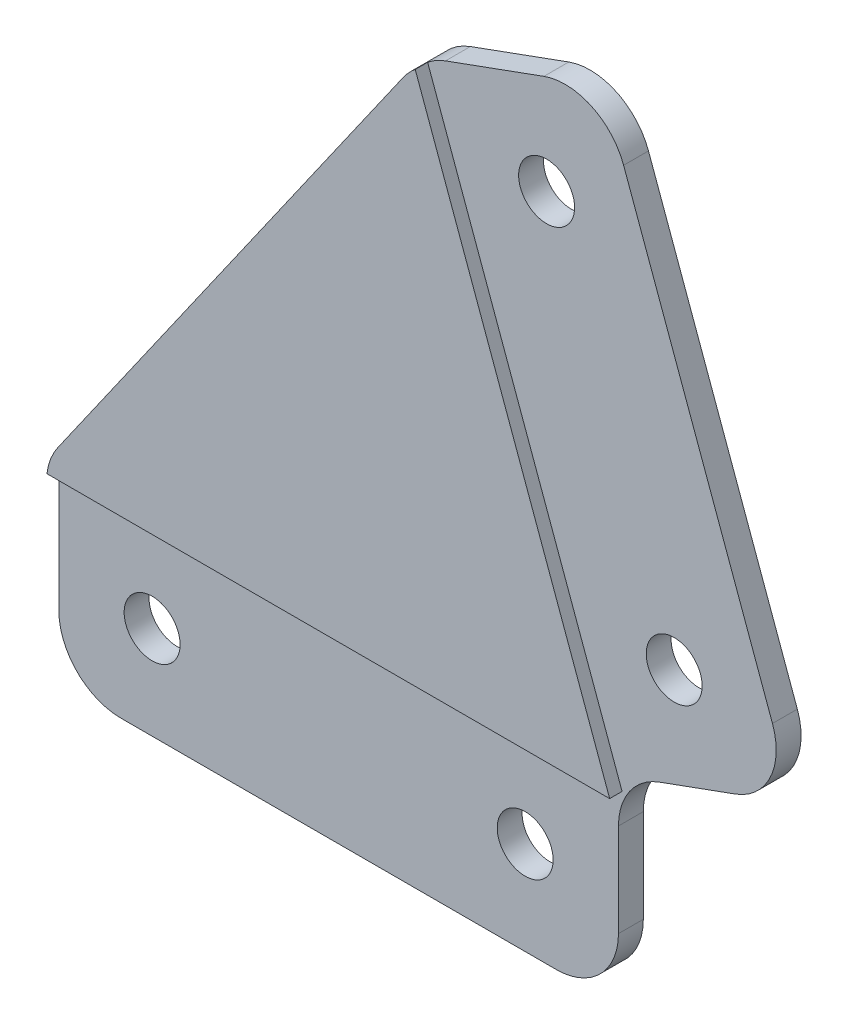
ISO-10303-21;
HEADER;
FILE_DESCRIPTION(('STEP AP214'),'2;1');
FILE_NAME('part.step','',(''),(''),'','','');
FILE_SCHEMA(('AUTOMOTIVE_DESIGN { 1 0 10303 214 1 1 1 1 }'));
ENDSEC;
DATA;
#1=APPLICATION_CONTEXT('core data for automotive mechanical design processes');
#2=APPLICATION_PROTOCOL_DEFINITION('international standard','automotive_design',2000,#1);
#3=PRODUCT_CONTEXT('',#1,'mechanical');
#4=PRODUCT('Part','Part','',(#3));
#5=PRODUCT_RELATED_PRODUCT_CATEGORY('part','',(#4));
#6=PRODUCT_DEFINITION_FORMATION('','',#4);
#7=PRODUCT_DEFINITION_CONTEXT('part definition',#1,'design');
#8=PRODUCT_DEFINITION('design','',#6,#7);
#9=PRODUCT_DEFINITION_SHAPE('','',#8);
#10=(LENGTH_UNIT() NAMED_UNIT(*) SI_UNIT(.MILLI.,.METRE.));
#11=(NAMED_UNIT(*) PLANE_ANGLE_UNIT() SI_UNIT($,.RADIAN.));
#12=(NAMED_UNIT(*) SI_UNIT($,.STERADIAN.) SOLID_ANGLE_UNIT());
#13=UNCERTAINTY_MEASURE_WITH_UNIT(LENGTH_MEASURE(1.E-05),#10,'distance_accuracy_value','');
#14=(GEOMETRIC_REPRESENTATION_CONTEXT(3) GLOBAL_UNCERTAINTY_ASSIGNED_CONTEXT((#13)) GLOBAL_UNIT_ASSIGNED_CONTEXT((#10,
#11,#12)) REPRESENTATION_CONTEXT('',''));
#15=CARTESIAN_POINT('',(0.,0.,0.));
#16=DIRECTION('',(0.,0.,1.));
#17=DIRECTION('',(1.,0.,0.));
#18=AXIS2_PLACEMENT_3D('',#15,#16,#17);
#19=CARTESIAN_POINT('',(0.,-15.9999999999991,3.));
#20=DIRECTION('',(0.,-1.,0.));
#21=DIRECTION('',(1.,0.,0.));
#22=AXIS2_PLACEMENT_3D('',#19,#20,#21);
#23=PLANE('',#22);
#24=DIRECTION('',(0.,0.,-1.));
#25=VECTOR('',#24,1.);
#26=CARTESIAN_POINT('',(435.,-16.0000000000001,3.));
#27=LINE('',#26,#25);
#28=CARTESIAN_POINT('',(435.,-16.0000000000001,0.));
#29=VERTEX_POINT('',#28);
#30=CARTESIAN_POINT('',(435.,-16.0000000000001,2.));
#31=VERTEX_POINT('',#30);
#32=EDGE_CURVE('E291',#29,#31,#27,.F.);
#33=ORIENTED_EDGE('',*,*,#32,.T.);
#34=DIRECTION('',(1.,0.,0.));
#35=VECTOR('',#34,1.);
#36=CARTESIAN_POINT('',(443.,-16.0000000000001,2.));
#37=LINE('',#36,#35);
#38=CARTESIAN_POINT('',(400.,-16.0000000000001,2.));
#39=VERTEX_POINT('',#38);
#40=EDGE_CURVE('E182',#39,#31,#37,.T.);
#41=ORIENTED_EDGE('',*,*,#40,.F.);
#42=DIRECTION('',(0.,0.,-1.));
#43=VECTOR('',#42,1.);
#44=CARTESIAN_POINT('',(400.,-16.,0.));
#45=LINE('',#44,#43);
#46=CARTESIAN_POINT('',(400.,-16.,0.));
#47=VERTEX_POINT('',#46);
#48=EDGE_CURVE('E289',#39,#47,#45,.T.);
#49=ORIENTED_EDGE('',*,*,#48,.T.);
#50=DIRECTION('',(-1.,0.,0.));
#51=VECTOR('',#50,1.);
#52=CARTESIAN_POINT('',(0.,-15.9999999999991,0.));
#53=LINE('',#52,#51);
#54=EDGE_CURVE('E227',#29,#47,#53,.T.);
#55=ORIENTED_EDGE('',*,*,#54,.F.);
#56=EDGE_LOOP('',(#33,#41,#49,#55));
#57=FACE_BOUND('',#56,.T.);
#58=ADVANCED_FACE('F40',(#57),#23,.T.);
#59=CARTESIAN_POINT('',(440.,0.,3.));
#60=DIRECTION('',(1.,0.,0.));
#61=DIRECTION('',(0.,0.,-1.));
#62=AXIS2_PLACEMENT_3D('',#59,#60,#61);
#63=PLANE('',#62);
#64=DIRECTION('',(0.,0.,-1.));
#65=VECTOR('',#64,1.);
#66=CARTESIAN_POINT('',(440.,-3.50103769104856,3.));
#67=LINE('',#66,#65);
#68=CARTESIAN_POINT('',(440.,-3.50103769104856,0.));
#69=VERTEX_POINT('',#68);
#70=CARTESIAN_POINT('',(440.,-3.50103769104856,2.));
#71=VERTEX_POINT('',#70);
#72=EDGE_CURVE('E284',#69,#71,#67,.F.);
#73=ORIENTED_EDGE('',*,*,#72,.T.);
#74=DIRECTION('',(0.,-1.,0.));
#75=VECTOR('',#74,1.);
#76=CARTESIAN_POINT('',(440.,0.,2.));
#77=LINE('',#76,#75);
#78=CARTESIAN_POINT('',(440.,-11.0000000000001,2.));
#79=VERTEX_POINT('',#78);
#80=EDGE_CURVE('E202',#71,#79,#77,.T.);
#81=ORIENTED_EDGE('',*,*,#80,.T.);
#82=DIRECTION('',(0.,0.,-1.));
#83=VECTOR('',#82,1.);
#84=CARTESIAN_POINT('',(440.,-11.0000000000001,3.));
#85=LINE('',#84,#83);
#86=CARTESIAN_POINT('',(440.,-11.0000000000001,0.));
#87=VERTEX_POINT('',#86);
#88=EDGE_CURVE('E287',#79,#87,#85,.T.);
#89=ORIENTED_EDGE('',*,*,#88,.T.);
#90=DIRECTION('',(0.,-1.,0.));
#91=VECTOR('',#90,1.);
#92=CARTESIAN_POINT('',(440.,0.,0.));
#93=LINE('',#92,#91);
#94=EDGE_CURVE('E242',#69,#87,#93,.T.);
#95=ORIENTED_EDGE('',*,*,#94,.F.);
#96=EDGE_LOOP('',(#73,#81,#89,#95));
#97=FACE_BOUND('',#96,.T.);
#98=ADVANCED_FACE('F334',(#97),#63,.T.);
#99=CARTESIAN_POINT('',(51.4702225138261,-141.41327413104,3.));
#100=DIRECTION('',(-0.342020143325673,0.939692620785907,0.));
#101=DIRECTION('',(-0.939692620785907,-0.342020143325673,0.));
#102=AXIS2_PLACEMENT_3D('',#99,#100,#101);
#103=PLANE('',#102);
#104=DIRECTION('',(0.939692620785907,0.342020143325673,0.));
#105=VECTOR('',#104,1.);
#106=CARTESIAN_POINT('',(51.4702225138261,-141.41327413104,2.));
#107=LINE('',#106,#105);
#108=CARTESIAN_POINT('',(443.289899283372,1.19742541288103,2.));
#109=VERTEX_POINT('',#108);
#110=CARTESIAN_POINT('',(449.396926207859,3.42020143325675,2.));
#111=VERTEX_POINT('',#110);
#112=EDGE_CURVE('E200',#109,#111,#107,.T.);
#113=ORIENTED_EDGE('',*,*,#112,.F.);
#114=DIRECTION('',(0.,0.,-1.));
#115=VECTOR('',#114,1.);
#116=CARTESIAN_POINT('',(443.289899283372,1.19742541288104,3.));
#117=LINE('',#116,#115);
#118=CARTESIAN_POINT('',(443.289899283372,1.19742541288104,0.));
#119=VERTEX_POINT('',#118);
#120=EDGE_CURVE('E274',#109,#119,#117,.T.);
#121=ORIENTED_EDGE('',*,*,#120,.T.);
#122=DIRECTION('',(0.939692620785907,0.342020143325673,0.));
#123=VECTOR('',#122,1.);
#124=CARTESIAN_POINT('',(51.4702225138261,-141.41327413104,0.));
#125=LINE('',#124,#123);
#126=CARTESIAN_POINT('',(449.396926207859,3.42020143325675,0.));
#127=VERTEX_POINT('',#126);
#128=EDGE_CURVE('E245',#119,#127,#125,.T.);
#129=ORIENTED_EDGE('',*,*,#128,.T.);
#130=DIRECTION('',(0.,0.,-1.));
#131=VECTOR('',#130,1.);
#132=CARTESIAN_POINT('',(449.396926207859,3.42020143325672,3.));
#133=LINE('',#132,#131);
#134=EDGE_CURVE('E276',#127,#111,#133,.F.);
#135=ORIENTED_EDGE('',*,*,#134,.T.);
#136=EDGE_LOOP('',(#113,#121,#129,#135));
#137=FACE_BOUND('',#136,.T.);
#138=ADVANCED_FACE('F344',(#137),#103,.F.);
#139=CARTESIAN_POINT('',(402.625166797963,146.543576280925,3.));
#140=DIRECTION('',(-0.939692620785907,-0.342020143325672,0.));
#141=DIRECTION('',(0.342020143325672,-0.939692620785907,0.));
#142=AXIS2_PLACEMENT_3D('',#139,#140,#141);
#143=PLANE('',#142);
#144=DIRECTION('',(-0.342020143325672,0.939692620785907,0.));
#145=VECTOR('',#144,1.);
#146=CARTESIAN_POINT('',(438.704482862133,47.4164700852509,2.));
#147=LINE('',#146,#145);
#148=CARTESIAN_POINT('',(452.38528859516,9.82876525381465,2.));
#149=VERTEX_POINT('',#148);
#150=CARTESIAN_POINT('',(440.414583578762,42.7180069813214,2.));
#151=VERTEX_POINT('',#150);
#152=EDGE_CURVE('E175',#149,#151,#147,.T.);
#153=ORIENTED_EDGE('',*,*,#152,.F.);
#154=DIRECTION('',(0.,0.,-1.));
#155=VECTOR('',#154,1.);
#156=CARTESIAN_POINT('',(452.38528859516,9.82876525381463,3.));
#157=LINE('',#156,#155);
#158=CARTESIAN_POINT('',(452.38528859516,9.8287652538146,0.));
#159=VERTEX_POINT('',#158);
#160=EDGE_CURVE('E260',#149,#159,#157,.T.);
#161=ORIENTED_EDGE('',*,*,#160,.T.);
#162=DIRECTION('',(-0.342020143325672,0.939692620785907,0.));
#163=VECTOR('',#162,1.);
#164=CARTESIAN_POINT('',(402.625166797963,146.543576280925,0.));
#165=LINE('',#164,#163);
#166=CARTESIAN_POINT('',(440.414583578762,42.7180069813213,0.));
#167=VERTEX_POINT('',#166);
#168=EDGE_CURVE('E248',#159,#167,#165,.T.);
#169=ORIENTED_EDGE('',*,*,#168,.T.);
#170=DIRECTION('',(0.,0.,-1.));
#171=VECTOR('',#170,1.);
#172=CARTESIAN_POINT('',(440.414583578762,42.7180069813214,3.));
#173=LINE('',#172,#171);
#174=EDGE_CURVE('E238',#167,#151,#173,.F.);
#175=ORIENTED_EDGE('',*,*,#174,.T.);
#176=EDGE_LOOP('',(#153,#161,#169,#175));
#177=FACE_BOUND('',#176,.T.);
#178=ADVANCED_FACE('F353',(#177),#143,.F.);
#179=CARTESIAN_POINT('',(36.0793160641707,-99.1271061956742,3.));
#180=DIRECTION('',(-0.342020143325672,0.939692620785907,0.));
#181=DIRECTION('',(-0.939692620785907,-0.342020143325672,0.));
#182=AXIS2_PLACEMENT_3D('',#179,#180,#181);
#183=PLANE('',#182);
#184=DIRECTION('',(0.,0.,-1.));
#185=VECTOR('',#184,1.);
#186=CARTESIAN_POINT('',(426.090513276606,42.8253606201797,3.));
#187=LINE('',#186,#185);
#188=CARTESIAN_POINT('',(426.090513276606,42.8253606201798,0.));
#189=VERTEX_POINT('',#188);
#190=CARTESIAN_POINT('',(426.090513276606,42.8253606201798,2.));
#191=VERTEX_POINT('',#190);
#192=EDGE_CURVE('E299',#189,#191,#187,.F.);
#193=ORIENTED_EDGE('',*,*,#192,.T.);
#194=DIRECTION('',(-0.939692620785907,-0.342020143325672,0.));
#195=VECTOR('',#194,1.);
#196=CARTESIAN_POINT('',(438.704482862133,47.4164700852509,2.));
#197=LINE('',#196,#195);
#198=CARTESIAN_POINT('',(434.006019758204,45.7063693686225,2.));
#199=VERTEX_POINT('',#198);
#200=EDGE_CURVE('E166',#199,#191,#197,.T.);
#201=ORIENTED_EDGE('',*,*,#200,.F.);
#202=DIRECTION('',(0.,0.,-1.));
#203=VECTOR('',#202,1.);
#204=CARTESIAN_POINT('',(434.006019758204,45.7063693686225,0.));
#205=LINE('',#204,#203);
#206=CARTESIAN_POINT('',(434.006019758204,45.7063693686226,0.));
#207=VERTEX_POINT('',#206);
#208=EDGE_CURVE('E302',#199,#207,#205,.T.);
#209=ORIENTED_EDGE('',*,*,#208,.T.);
#210=DIRECTION('',(0.939692620785907,0.342020143325672,0.));
#211=VECTOR('',#210,1.);
#212=CARTESIAN_POINT('',(36.0793160641707,-99.1271061956742,0.));
#213=LINE('',#212,#211);
#214=EDGE_CURVE('E251',#189,#207,#213,.T.);
#215=ORIENTED_EDGE('',*,*,#214,.F.);
#216=EDGE_LOOP('',(#193,#201,#209,#215));
#217=FACE_BOUND('',#216,.T.);
#218=ADVANCED_FACE('F361',(#217),#183,.T.);
#219=CARTESIAN_POINT('',(395.,0.,3.));
#220=DIRECTION('',(1.,0.,0.));
#221=DIRECTION('',(0.,0.,-1.));
#222=AXIS2_PLACEMENT_3D('',#219,#220,#221);
#223=PLANE('',#222);
#224=DIRECTION('',(0.,-1.,0.));
#225=VECTOR('',#224,1.);
#226=CARTESIAN_POINT('',(395.,-16.0000000000001,2.));
#227=LINE('',#226,#225);
#228=CARTESIAN_POINT('',(395.,-1.5764939443949,2.));
#229=VERTEX_POINT('',#228);
#230=CARTESIAN_POINT('',(395.,-11.,2.));
#231=VERTEX_POINT('',#230);
#232=EDGE_CURVE('E180',#229,#231,#227,.T.);
#233=ORIENTED_EDGE('',*,*,#232,.F.);
#234=DIRECTION('',(0.,0.,-1.));
#235=VECTOR('',#234,1.);
#236=CARTESIAN_POINT('',(395.,-1.5764939443949,3.));
#237=LINE('',#236,#235);
#238=CARTESIAN_POINT('',(395.,-1.5764939443949,0.));
#239=VERTEX_POINT('',#238);
#240=EDGE_CURVE('E294',#229,#239,#237,.T.);
#241=ORIENTED_EDGE('',*,*,#240,.T.);
#242=DIRECTION('',(0.,-1.,0.));
#243=VECTOR('',#242,1.);
#244=CARTESIAN_POINT('',(395.,0.,0.));
#245=LINE('',#244,#243);
#246=CARTESIAN_POINT('',(395.,-11.,0.));
#247=VERTEX_POINT('',#246);
#248=EDGE_CURVE('E239',#239,#247,#245,.T.);
#249=ORIENTED_EDGE('',*,*,#248,.T.);
#250=DIRECTION('',(0.,0.,-1.));
#251=VECTOR('',#250,1.);
#252=CARTESIAN_POINT('',(395.,-11.,3.));
#253=LINE('',#252,#251);
#254=EDGE_CURVE('E296',#247,#231,#253,.F.);
#255=ORIENTED_EDGE('',*,*,#254,.T.);
#256=EDGE_LOOP('',(#233,#241,#249,#255));
#257=FACE_BOUND('',#256,.T.);
#258=ADVANCED_FACE('F317',(#257),#223,.F.);
#259=CARTESIAN_POINT('',(444.482543580952,9.61284573083683,0.));
#260=DIRECTION('',(0.,0.,1.));
#261=DIRECTION('',(1.,0.,0.));
#262=AXIS2_PLACEMENT_3D('',#259,#260,#261);
#263=CYLINDRICAL_SURFACE('',#262,2.24999999999995);
#264=CARTESIAN_POINT('',(444.482543580952,9.61284573083683,0.));
#265=DIRECTION('',(0.,0.,1.));
#266=DIRECTION('',(1.,0.,0.));
#267=AXIS2_PLACEMENT_3D('',#264,#265,#266);
#268=CIRCLE('',#267,2.24999999999995);
#269=CARTESIAN_POINT('',(446.732543580952,9.61284573083683,0.));
#270=VERTEX_POINT('',#269);
#271=EDGE_CURVE('E223',#270,#270,#268,.T.);
#272=ORIENTED_EDGE('',*,*,#271,.F.);
#273=EDGE_LOOP('',(#272));
#274=FACE_BOUND('',#273,.T.);
#275=CARTESIAN_POINT('',(444.482543580952,9.61284573083683,2.));
#276=DIRECTION('',(0.,0.,1.));
#277=DIRECTION('',(1.,0.,0.));
#278=AXIS2_PLACEMENT_3D('',#275,#276,#277);
#279=CIRCLE('',#278,2.24999999999995);
#280=CARTESIAN_POINT('',(446.732543580952,9.61284573083683,2.));
#281=VERTEX_POINT('',#280);
#282=EDGE_CURVE('E220',#281,#281,#279,.F.);
#283=ORIENTED_EDGE('',*,*,#282,.F.);
#284=EDGE_LOOP('',(#283));
#285=FACE_BOUND('',#284,.T.);
#286=ADVANCED_FACE('F412',(#274,#285),#263,.F.);
#287=CARTESIAN_POINT('',(434.221939281182,37.8036243544141,0.));
#288=DIRECTION('',(0.,0.,1.));
#289=DIRECTION('',(1.,0.,0.));
#290=AXIS2_PLACEMENT_3D('',#287,#288,#289);
#291=CYLINDRICAL_SURFACE('',#290,2.24999999999995);
#292=CARTESIAN_POINT('',(434.221939281182,37.8036243544141,0.));
#293=DIRECTION('',(0.,0.,1.));
#294=DIRECTION('',(1.,0.,0.));
#295=AXIS2_PLACEMENT_3D('',#292,#293,#294);
#296=CIRCLE('',#295,2.24999999999995);
#297=CARTESIAN_POINT('',(436.471939281182,37.8036243544141,0.));
#298=VERTEX_POINT('',#297);
#299=EDGE_CURVE('E231',#298,#298,#296,.T.);
#300=ORIENTED_EDGE('',*,*,#299,.F.);
#301=EDGE_LOOP('',(#300));
#302=FACE_BOUND('',#301,.T.);
#303=CARTESIAN_POINT('',(434.221939281182,37.8036243544141,2.));
#304=DIRECTION('',(0.,0.,1.));
#305=DIRECTION('',(1.,0.,0.));
#306=AXIS2_PLACEMENT_3D('',#303,#304,#305);
#307=CIRCLE('',#306,2.24999999999995);
#308=CARTESIAN_POINT('',(436.471939281182,37.8036243544141,2.));
#309=VERTEX_POINT('',#308);
#310=EDGE_CURVE('E217',#309,#309,#307,.F.);
#311=ORIENTED_EDGE('',*,*,#310,.F.);
#312=EDGE_LOOP('',(#311));
#313=FACE_BOUND('',#312,.T.);
#314=ADVANCED_FACE('F417',(#302,#313),#291,.F.);
#315=CARTESIAN_POINT('',(432.5,-8.5000000000001,0.));
#316=DIRECTION('',(0.,0.,1.));
#317=DIRECTION('',(1.,0.,0.));
#318=AXIS2_PLACEMENT_3D('',#315,#316,#317);
#319=CYLINDRICAL_SURFACE('',#318,2.24999999999995);
#320=CARTESIAN_POINT('',(432.5,-8.5000000000001,0.));
#321=DIRECTION('',(0.,0.,1.));
#322=DIRECTION('',(1.,0.,0.));
#323=AXIS2_PLACEMENT_3D('',#320,#321,#322);
#324=CIRCLE('',#323,2.24999999999995);
#325=CARTESIAN_POINT('',(434.75,-8.5000000000001,0.));
#326=VERTEX_POINT('',#325);
#327=EDGE_CURVE('E228',#326,#326,#324,.T.);
#328=ORIENTED_EDGE('',*,*,#327,.F.);
#329=EDGE_LOOP('',(#328));
#330=FACE_BOUND('',#329,.T.);
#331=CARTESIAN_POINT('',(432.5,-8.5000000000001,2.));
#332=DIRECTION('',(0.,0.,1.));
#333=DIRECTION('',(1.,0.,0.));
#334=AXIS2_PLACEMENT_3D('',#331,#332,#333);
#335=CIRCLE('',#334,2.24999999999995);
#336=CARTESIAN_POINT('',(434.75,-8.5000000000001,2.));
#337=VERTEX_POINT('',#336);
#338=EDGE_CURVE('E214',#337,#337,#335,.F.);
#339=ORIENTED_EDGE('',*,*,#338,.F.);
#340=EDGE_LOOP('',(#339));
#341=FACE_BOUND('',#340,.T.);
#342=ADVANCED_FACE('F455',(#330,#341),#319,.F.);
#343=CARTESIAN_POINT('',(402.5,-8.5000000000001,0.));
#344=DIRECTION('',(0.,0.,1.));
#345=DIRECTION('',(1.,0.,0.));
#346=AXIS2_PLACEMENT_3D('',#343,#344,#345);
#347=CYLINDRICAL_SURFACE('',#346,2.24999999999995);
#348=CARTESIAN_POINT('',(402.5,-8.5000000000001,0.));
#349=DIRECTION('',(0.,0.,1.));
#350=DIRECTION('',(1.,0.,0.));
#351=AXIS2_PLACEMENT_3D('',#348,#349,#350);
#352=CIRCLE('',#351,2.24999999999995);
#353=CARTESIAN_POINT('',(404.75,-8.5000000000001,0.));
#354=VERTEX_POINT('',#353);
#355=EDGE_CURVE('E224',#354,#354,#352,.T.);
#356=ORIENTED_EDGE('',*,*,#355,.F.);
#357=EDGE_LOOP('',(#356));
#358=FACE_BOUND('',#357,.T.);
#359=CARTESIAN_POINT('',(402.5,-8.5000000000001,2.));
#360=DIRECTION('',(0.,0.,1.));
#361=DIRECTION('',(1.,0.,0.));
#362=AXIS2_PLACEMENT_3D('',#359,#360,#361);
#363=CIRCLE('',#362,2.24999999999995);
#364=CARTESIAN_POINT('',(404.75,-8.5000000000001,2.));
#365=VERTEX_POINT('',#364);
#366=EDGE_CURVE('E211',#365,#365,#363,.F.);
#367=ORIENTED_EDGE('',*,*,#366,.F.);
#368=EDGE_LOOP('',(#367));
#369=FACE_BOUND('',#368,.T.);
#370=ADVANCED_FACE('F395',(#358,#369),#347,.F.);
#371=CARTESIAN_POINT('',(447.686825491231,8.11866453718629,3.));
#372=DIRECTION('',(0.,0.,-1.));
#373=DIRECTION('',(-1.,0.,0.));
#374=AXIS2_PLACEMENT_3D('',#371,#372,#373);
#375=CYLINDRICAL_SURFACE('',#374,5.);
#376=ORIENTED_EDGE('',*,*,#160,.F.);
#377=CARTESIAN_POINT('',(447.686825491231,8.11866453718629,2.));
#378=DIRECTION('',(0.,0.,1.));
#379=DIRECTION('',(1.,0.,0.));
#380=AXIS2_PLACEMENT_3D('',#377,#378,#379);
#381=CIRCLE('',#380,5.);
#382=EDGE_CURVE('E208',#149,#111,#381,.F.);
#383=ORIENTED_EDGE('',*,*,#382,.T.);
#384=ORIENTED_EDGE('',*,*,#134,.F.);
#385=CARTESIAN_POINT('',(447.686825491231,8.11866453718629,0.));
#386=DIRECTION('',(0.,0.,1.));
#387=DIRECTION('',(1.,0.,0.));
#388=AXIS2_PLACEMENT_3D('',#385,#386,#387);
#389=CIRCLE('',#388,5.);
#390=EDGE_CURVE('E272',#159,#127,#389,.F.);
#391=ORIENTED_EDGE('',*,*,#390,.F.);
#392=EDGE_LOOP('',(#376,#383,#384,#391));
#393=FACE_BOUND('',#392,.T.);
#394=ADVANCED_FACE('F349',(#393),#375,.T.);
#395=CARTESIAN_POINT('',(435.,-11.0000000000001,3.));
#396=DIRECTION('',(0.,0.,-1.));
#397=DIRECTION('',(-1.,0.,0.));
#398=AXIS2_PLACEMENT_3D('',#395,#396,#397);
#399=CYLINDRICAL_SURFACE('',#398,5.);
#400=ORIENTED_EDGE('',*,*,#88,.F.);
#401=CARTESIAN_POINT('',(435.,-11.0000000000001,2.));
#402=DIRECTION('',(0.,0.,1.));
#403=DIRECTION('',(1.,0.,0.));
#404=AXIS2_PLACEMENT_3D('',#401,#402,#403);
#405=CIRCLE('',#404,5.);
#406=EDGE_CURVE('E205',#79,#31,#405,.F.);
#407=ORIENTED_EDGE('',*,*,#406,.T.);
#408=ORIENTED_EDGE('',*,*,#32,.F.);
#409=CARTESIAN_POINT('',(435.,-11.0000000000001,0.));
#410=DIRECTION('',(0.,0.,1.));
#411=DIRECTION('',(1.,0.,0.));
#412=AXIS2_PLACEMENT_3D('',#409,#410,#411);
#413=CIRCLE('',#412,5.);
#414=EDGE_CURVE('E270',#87,#29,#413,.F.);
#415=ORIENTED_EDGE('',*,*,#414,.F.);
#416=EDGE_LOOP('',(#400,#407,#408,#415));
#417=FACE_BOUND('',#416,.T.);
#418=ADVANCED_FACE('F331',(#417),#399,.T.);
#419=CARTESIAN_POINT('',(445.,-3.50103769104856,3.));
#420=DIRECTION('',(0.,0.,-1.));
#421=DIRECTION('',(-1.,0.,0.));
#422=AXIS2_PLACEMENT_3D('',#419,#420,#421);
#423=CYLINDRICAL_SURFACE('',#422,5.);
#424=CARTESIAN_POINT('',(445.,-3.50103769104856,2.));
#425=DIRECTION('',(0.,0.,1.));
#426=DIRECTION('',(1.,0.,0.));
#427=AXIS2_PLACEMENT_3D('',#424,#425,#426);
#428=CIRCLE('',#427,5.);
#429=EDGE_CURVE('E198',#71,#109,#428,.F.);
#430=ORIENTED_EDGE('',*,*,#429,.F.);
#431=ORIENTED_EDGE('',*,*,#72,.F.);
#432=CARTESIAN_POINT('',(445.,-3.50103769104856,0.));
#433=DIRECTION('',(0.,0.,1.));
#434=DIRECTION('',(1.,0.,0.));
#435=AXIS2_PLACEMENT_3D('',#432,#433,#434);
#436=CIRCLE('',#435,5.);
#437=EDGE_CURVE('E308',#119,#69,#436,.T.);
#438=ORIENTED_EDGE('',*,*,#437,.F.);
#439=ORIENTED_EDGE('',*,*,#120,.F.);
#440=EDGE_LOOP('',(#430,#431,#438,#439));
#441=FACE_BOUND('',#440,.T.);
#442=ADVANCED_FACE('F339',(#441),#423,.F.);
#443=CARTESIAN_POINT('',(400.,-11.,3.));
#444=DIRECTION('',(0.,0.,1.));
#445=DIRECTION('',(1.,0.,0.));
#446=AXIS2_PLACEMENT_3D('',#443,#444,#445);
#447=CYLINDRICAL_SURFACE('',#446,5.);
#448=ORIENTED_EDGE('',*,*,#48,.F.);
#449=CARTESIAN_POINT('',(400.,-11.,2.));
#450=DIRECTION('',(0.,0.,1.));
#451=DIRECTION('',(1.,0.,0.));
#452=AXIS2_PLACEMENT_3D('',#449,#450,#451);
#453=CIRCLE('',#452,5.);
#454=EDGE_CURVE('E195',#39,#231,#453,.F.);
#455=ORIENTED_EDGE('',*,*,#454,.T.);
#456=ORIENTED_EDGE('',*,*,#254,.F.);
#457=CARTESIAN_POINT('',(400.,-11.,0.));
#458=DIRECTION('',(0.,0.,1.));
#459=DIRECTION('',(1.,0.,0.));
#460=AXIS2_PLACEMENT_3D('',#457,#458,#459);
#461=CIRCLE('',#460,5.);
#462=EDGE_CURVE('E268',#47,#247,#461,.F.);
#463=ORIENTED_EDGE('',*,*,#462,.F.);
#464=EDGE_LOOP('',(#448,#455,#456,#463));
#465=FACE_BOUND('',#464,.T.);
#466=ADVANCED_FACE('F323',(#465),#447,.T.);
#467=CARTESIAN_POINT('',(435.716120474832,41.007906264693,3.));
#468=DIRECTION('',(0.,0.,1.));
#469=DIRECTION('',(1.,0.,0.));
#470=AXIS2_PLACEMENT_3D('',#467,#468,#469);
#471=CYLINDRICAL_SURFACE('',#470,5.);
#472=ORIENTED_EDGE('',*,*,#208,.F.);
#473=CARTESIAN_POINT('',(435.716120474832,41.007906264693,2.));
#474=DIRECTION('',(0.,0.,1.));
#475=DIRECTION('',(1.,0.,0.));
#476=AXIS2_PLACEMENT_3D('',#473,#474,#475);
#477=CIRCLE('',#476,5.);
#478=EDGE_CURVE('E192',#199,#151,#477,.F.);
#479=ORIENTED_EDGE('',*,*,#478,.T.);
#480=ORIENTED_EDGE('',*,*,#174,.F.);
#481=CARTESIAN_POINT('',(435.716120474832,41.007906264693,0.));
#482=DIRECTION('',(0.,0.,1.));
#483=DIRECTION('',(1.,0.,0.));
#484=AXIS2_PLACEMENT_3D('',#481,#482,#483);
#485=CIRCLE('',#484,5.);
#486=EDGE_CURVE('E266',#207,#167,#485,.F.);
#487=ORIENTED_EDGE('',*,*,#486,.F.);
#488=EDGE_LOOP('',(#472,#479,#480,#487));
#489=FACE_BOUND('',#488,.T.);
#490=ADVANCED_FACE('F358',(#489),#471,.T.);
#491=CARTESIAN_POINT('',(265.048978306821,-185.589292605217,3.));
#492=DIRECTION('',(0.819152044288993,-0.573576436351044,0.));
#493=DIRECTION('',(0.573576436351044,0.819152044288994,0.));
#494=AXIS2_PLACEMENT_3D('',#491,#492,#493);
#495=PLANE('',#494);
#496=DIRECTION('',(-0.573576436351044,-0.819152044288994,0.));
#497=VECTOR('',#496,1.);
#498=CARTESIAN_POINT('',(265.048978306821,-185.589292605217,3.));
#499=LINE('',#498,#497);
#500=CARTESIAN_POINT('',(423.70485377179,40.9947796980056,3.));
#501=VERTEX_POINT('',#500);
#502=CARTESIAN_POINT('',(395.904239778555,1.29138823736041,3.));
#503=VERTEX_POINT('',#502);
#504=EDGE_CURVE('E236',#501,#503,#499,.T.);
#505=ORIENTED_EDGE('',*,*,#504,.F.);
#506=DIRECTION('',(0.,0.,-1.));
#507=VECTOR('',#506,1.);
#508=CARTESIAN_POINT('',(423.70485377179,40.9947796980054,0.));
#509=LINE('',#508,#507);
#510=CARTESIAN_POINT('',(423.70485377179,40.9947796980056,0.));
#511=VERTEX_POINT('',#510);
#512=EDGE_CURVE('E305',#501,#511,#509,.T.);
#513=ORIENTED_EDGE('',*,*,#512,.T.);
#514=DIRECTION('',(-0.573576436351044,-0.819152044288994,0.));
#515=VECTOR('',#514,1.);
#516=CARTESIAN_POINT('',(265.048978306821,-185.589292605217,0.));
#517=LINE('',#516,#515);
#518=CARTESIAN_POINT('',(395.904239778555,1.29138823736041,0.));
#519=VERTEX_POINT('',#518);
#520=EDGE_CURVE('E254',#511,#519,#517,.T.);
#521=ORIENTED_EDGE('',*,*,#520,.T.);
#522=DIRECTION('',(0.,0.,-1.));
#523=VECTOR('',#522,1.);
#524=CARTESIAN_POINT('',(395.904239778555,1.29138823736033,3.));
#525=LINE('',#524,#523);
#526=EDGE_CURVE('E63',#519,#503,#525,.F.);
#527=ORIENTED_EDGE('',*,*,#526,.T.);
#528=EDGE_LOOP('',(#505,#513,#521,#527));
#529=FACE_BOUND('',#528,.T.);
#530=ADVANCED_FACE('F373',(#529),#495,.F.);
#531=CARTESIAN_POINT('',(0.,0.,3.));
#532=DIRECTION('',(0.,0.,1.));
#533=DIRECTION('',(1.,0.,0.));
#534=AXIS2_PLACEMENT_3D('',#531,#532,#533);
#535=PLANE('',#534);
#536=DIRECTION('',(-1.,0.,0.));
#537=VECTOR('',#536,1.);
#538=CARTESIAN_POINT('',(440.292562833929,-0.950000000000078,3.));
#539=LINE('',#538,#537);
#540=CARTESIAN_POINT('',(440.292562833929,-0.950000000000078,3.));
#541=VERTEX_POINT('',#540);
#542=CARTESIAN_POINT('',(395.039404739587,-0.950000000000093,3.));
#543=VERTEX_POINT('',#542);
#544=EDGE_CURVE('E189',#541,#543,#539,.T.);
#545=ORIENTED_EDGE('',*,*,#544,.F.);
#546=DIRECTION('',(0.342020143325673,-0.939692620785907,0.));
#547=VECTOR('',#546,1.);
#548=CARTESIAN_POINT('',(424.562108919305,42.2690669281995,3.));
#549=LINE('',#548,#547);
#550=CARTESIAN_POINT('',(424.655119103751,42.0135235466565,3.));
#551=VERTEX_POINT('',#550);
#552=EDGE_CURVE('E172',#551,#541,#549,.T.);
#553=ORIENTED_EDGE('',*,*,#552,.F.);
#554=CARTESIAN_POINT('',(427.800613993235,38.1268975162502,3.));
#555=DIRECTION('',(0.,0.,1.));
#556=DIRECTION('',(1.,0.,0.));
#557=AXIS2_PLACEMENT_3D('',#554,#555,#556);
#558=CIRCLE('',#557,5.);
#559=EDGE_CURVE('E282',#551,#501,#558,.T.);
#560=ORIENTED_EDGE('',*,*,#559,.T.);
#561=ORIENTED_EDGE('',*,*,#504,.T.);
#562=CARTESIAN_POINT('',(400.,-1.5764939443949,3.));
#563=DIRECTION('',(0.,0.,1.));
#564=DIRECTION('',(1.,0.,0.));
#565=AXIS2_PLACEMENT_3D('',#562,#563,#564);
#566=CIRCLE('',#565,5.);
#567=EDGE_CURVE('E279',#503,#543,#566,.T.);
#568=ORIENTED_EDGE('',*,*,#567,.T.);
#569=EDGE_LOOP('',(#545,#553,#560,#561,#568));
#570=FACE_BOUND('',#569,.T.);
#571=ADVANCED_FACE('F369',(#570),#535,.T.);
#572=CARTESIAN_POINT('',(0.,0.,0.));
#573=DIRECTION('',(0.,0.,1.));
#574=DIRECTION('',(1.,0.,0.));
#575=AXIS2_PLACEMENT_3D('',#572,#573,#574);
#576=PLANE('',#575);
#577=ORIENTED_EDGE('',*,*,#355,.T.);
#578=EDGE_LOOP('',(#577));
#579=FACE_BOUND('',#578,.T.);
#580=ORIENTED_EDGE('',*,*,#327,.T.);
#581=EDGE_LOOP('',(#580));
#582=FACE_BOUND('',#581,.T.);
#583=ORIENTED_EDGE('',*,*,#299,.T.);
#584=EDGE_LOOP('',(#583));
#585=FACE_BOUND('',#584,.T.);
#586=ORIENTED_EDGE('',*,*,#271,.T.);
#587=EDGE_LOOP('',(#586));
#588=FACE_BOUND('',#587,.T.);
#589=ORIENTED_EDGE('',*,*,#168,.F.);
#590=ORIENTED_EDGE('',*,*,#390,.T.);
#591=ORIENTED_EDGE('',*,*,#128,.F.);
#592=ORIENTED_EDGE('',*,*,#437,.T.);
#593=ORIENTED_EDGE('',*,*,#94,.T.);
#594=ORIENTED_EDGE('',*,*,#414,.T.);
#595=ORIENTED_EDGE('',*,*,#54,.T.);
#596=ORIENTED_EDGE('',*,*,#462,.T.);
#597=ORIENTED_EDGE('',*,*,#248,.F.);
#598=CARTESIAN_POINT('',(400.,-1.5764939443949,0.));
#599=DIRECTION('',(0.,0.,1.));
#600=DIRECTION('',(1.,0.,0.));
#601=AXIS2_PLACEMENT_3D('',#598,#599,#600);
#602=CIRCLE('',#601,5.);
#603=EDGE_CURVE('E262',#239,#519,#602,.F.);
#604=ORIENTED_EDGE('',*,*,#603,.T.);
#605=ORIENTED_EDGE('',*,*,#520,.F.);
#606=CARTESIAN_POINT('',(427.800613993235,38.1268975162502,0.));
#607=DIRECTION('',(0.,0.,1.));
#608=DIRECTION('',(1.,0.,0.));
#609=AXIS2_PLACEMENT_3D('',#606,#607,#608);
#610=CIRCLE('',#609,5.);
#611=EDGE_CURVE('E264',#511,#189,#610,.F.);
#612=ORIENTED_EDGE('',*,*,#611,.T.);
#613=ORIENTED_EDGE('',*,*,#214,.T.);
#614=ORIENTED_EDGE('',*,*,#486,.T.);
#615=EDGE_LOOP('',(#589,#590,#591,#592,#593,#594,#595,#596,#597,#604,#605,#612,#613,#614));
#616=FACE_BOUND('',#615,.T.);
#617=ADVANCED_FACE('F372',(#579,#582,#585,#588,#616),#576,.F.);
#618=CARTESIAN_POINT('',(427.800613993235,38.1268975162502,3.));
#619=DIRECTION('',(0.,0.,1.));
#620=DIRECTION('',(1.,0.,0.));
#621=AXIS2_PLACEMENT_3D('',#618,#619,#620);
#622=CYLINDRICAL_SURFACE('',#621,5.);
#623=DIRECTION('',(0.,0.,1.));
#624=VECTOR('',#623,1.);
#625=CARTESIAN_POINT('',(424.655119103751,42.0135235466565,3.));
#626=LINE('',#625,#624);
#627=CARTESIAN_POINT('',(424.655119103751,42.0135235466565,2.));
#628=VERTEX_POINT('',#627);
#629=EDGE_CURVE('E11',#628,#551,#626,.T.);
#630=ORIENTED_EDGE('',*,*,#629,.F.);
#631=CARTESIAN_POINT('',(427.800613993235,38.1268975162502,2.));
#632=DIRECTION('',(0.,0.,1.));
#633=DIRECTION('',(1.,0.,0.));
#634=AXIS2_PLACEMENT_3D('',#631,#632,#633);
#635=CIRCLE('',#634,5.);
#636=EDGE_CURVE('E163',#628,#191,#635,.F.);
#637=ORIENTED_EDGE('',*,*,#636,.T.);
#638=ORIENTED_EDGE('',*,*,#192,.F.);
#639=ORIENTED_EDGE('',*,*,#611,.F.);
#640=ORIENTED_EDGE('',*,*,#512,.F.);
#641=ORIENTED_EDGE('',*,*,#559,.F.);
#642=EDGE_LOOP('',(#630,#637,#638,#639,#640,#641));
#643=FACE_BOUND('',#642,.T.);
#644=ADVANCED_FACE('F365',(#643),#622,.T.);
#645=CARTESIAN_POINT('',(400.,-1.5764939443949,3.));
#646=DIRECTION('',(0.,0.,-1.));
#647=DIRECTION('',(-1.,0.,0.));
#648=AXIS2_PLACEMENT_3D('',#645,#646,#647);
#649=CYLINDRICAL_SURFACE('',#648,5.);
#650=DIRECTION('',(0.,0.,-1.));
#651=VECTOR('',#650,1.);
#652=CARTESIAN_POINT('',(395.039404739587,-0.950000000000093,3.));
#653=LINE('',#652,#651);
#654=CARTESIAN_POINT('',(395.039404739587,-0.950000000000093,2.));
#655=VERTEX_POINT('',#654);
#656=EDGE_CURVE('E48',#543,#655,#653,.T.);
#657=ORIENTED_EDGE('',*,*,#656,.F.);
#658=ORIENTED_EDGE('',*,*,#567,.F.);
#659=ORIENTED_EDGE('',*,*,#526,.F.);
#660=ORIENTED_EDGE('',*,*,#603,.F.);
#661=ORIENTED_EDGE('',*,*,#240,.F.);
#662=CARTESIAN_POINT('',(400.,-1.5764939443949,2.));
#663=DIRECTION('',(0.,0.,1.));
#664=DIRECTION('',(1.,0.,0.));
#665=AXIS2_PLACEMENT_3D('',#662,#663,#664);
#666=CIRCLE('',#665,5.);
#667=EDGE_CURVE('E310',#229,#655,#666,.F.);
#668=ORIENTED_EDGE('',*,*,#667,.T.);
#669=EDGE_LOOP('',(#657,#658,#659,#660,#661,#668));
#670=FACE_BOUND('',#669,.T.);
#671=ADVANCED_FACE('F42',(#670),#649,.T.);
#672=CARTESIAN_POINT('',(0.,0.,2.));
#673=DIRECTION('',(0.,0.,1.));
#674=DIRECTION('',(1.,0.,0.));
#675=AXIS2_PLACEMENT_3D('',#672,#673,#674);
#676=PLANE('',#675);
#677=ORIENTED_EDGE('',*,*,#152,.T.);
#678=ORIENTED_EDGE('',*,*,#478,.F.);
#679=ORIENTED_EDGE('',*,*,#200,.T.);
#680=ORIENTED_EDGE('',*,*,#636,.F.);
#681=DIRECTION('',(0.342020143325673,-0.939692620785907,0.));
#682=VECTOR('',#681,1.);
#683=CARTESIAN_POINT('',(424.562108919305,42.2690669281995,2.));
#684=LINE('',#683,#682);
#685=CARTESIAN_POINT('',(440.292562833929,-0.950000000000078,2.));
#686=VERTEX_POINT('',#685);
#687=EDGE_CURVE('E158',#628,#686,#684,.T.);
#688=ORIENTED_EDGE('',*,*,#687,.T.);
#689=DIRECTION('',(-1.,0.,0.));
#690=VECTOR('',#689,1.);
#691=CARTESIAN_POINT('',(440.292562833929,-0.950000000000078,2.));
#692=LINE('',#691,#690);
#693=EDGE_CURVE('E55',#686,#655,#692,.T.);
#694=ORIENTED_EDGE('',*,*,#693,.T.);
#695=ORIENTED_EDGE('',*,*,#667,.F.);
#696=ORIENTED_EDGE('',*,*,#232,.T.);
#697=ORIENTED_EDGE('',*,*,#454,.F.);
#698=ORIENTED_EDGE('',*,*,#40,.T.);
#699=ORIENTED_EDGE('',*,*,#406,.F.);
#700=ORIENTED_EDGE('',*,*,#80,.F.);
#701=ORIENTED_EDGE('',*,*,#429,.T.);
#702=ORIENTED_EDGE('',*,*,#112,.T.);
#703=ORIENTED_EDGE('',*,*,#382,.F.);
#704=EDGE_LOOP('',(#677,#678,#679,#680,#688,#694,#695,#696,#697,#698,#699,#700,#701,#702,#703));
#705=FACE_BOUND('',#704,.T.);
#706=ORIENTED_EDGE('',*,*,#366,.T.);
#707=EDGE_LOOP('',(#706));
#708=FACE_BOUND('',#707,.T.);
#709=ORIENTED_EDGE('',*,*,#338,.T.);
#710=EDGE_LOOP('',(#709));
#711=FACE_BOUND('',#710,.T.);
#712=ORIENTED_EDGE('',*,*,#310,.T.);
#713=EDGE_LOOP('',(#712));
#714=FACE_BOUND('',#713,.T.);
#715=ORIENTED_EDGE('',*,*,#282,.T.);
#716=EDGE_LOOP('',(#715));
#717=FACE_BOUND('',#716,.T.);
#718=ADVANCED_FACE('F160',(#705,#708,#711,#714,#717),#676,.T.);
#719=CARTESIAN_POINT('',(440.292562833929,-0.950000000000078,2.));
#720=DIRECTION('',(0.,1.,0.));
#721=DIRECTION('',(-1.,0.,0.));
#722=AXIS2_PLACEMENT_3D('',#719,#720,#721);
#723=PLANE('',#722);
#724=ORIENTED_EDGE('',*,*,#656,.T.);
#725=ORIENTED_EDGE('',*,*,#693,.F.);
#726=DIRECTION('',(0.,0.,1.));
#727=VECTOR('',#726,1.);
#728=CARTESIAN_POINT('',(440.292562833929,-0.950000000000078,2.));
#729=LINE('',#728,#727);
#730=EDGE_CURVE('E169',#686,#541,#729,.T.);
#731=ORIENTED_EDGE('',*,*,#730,.T.);
#732=ORIENTED_EDGE('',*,*,#544,.T.);
#733=EDGE_LOOP('',(#724,#725,#731,#732));
#734=FACE_BOUND('',#733,.T.);
#735=ADVANCED_FACE('F177',(#734),#723,.F.);
#736=CARTESIAN_POINT('',(424.562108919305,42.2690669281995,2.));
#737=DIRECTION('',(-0.939692620785907,-0.342020143325673,0.));
#738=DIRECTION('',(0.342020143325673,-0.939692620785907,0.));
#739=AXIS2_PLACEMENT_3D('',#736,#737,#738);
#740=PLANE('',#739);
#741=ORIENTED_EDGE('',*,*,#629,.T.);
#742=ORIENTED_EDGE('',*,*,#552,.T.);
#743=ORIENTED_EDGE('',*,*,#730,.F.);
#744=ORIENTED_EDGE('',*,*,#687,.F.);
#745=EDGE_LOOP('',(#741,#742,#743,#744));
#746=FACE_BOUND('',#745,.T.);
#747=ADVANCED_FACE('F170',(#746),#740,.F.);
#748=CLOSED_SHELL('',(#58,#98,#138,#178,#218,#258,#286,#314,#342,#370,#394,#418,#442,#466,#490,
#530,#571,#617,#644,#671,#718,#735,#747));
#749=MANIFOLD_SOLID_BREP('B2',#748);
#750=ADVANCED_BREP_SHAPE_REPRESENTATION('',(#18,#749),#14);
#751=SHAPE_DEFINITION_REPRESENTATION(#9,#750);
ENDSEC;
END-ISO-10303-21;
